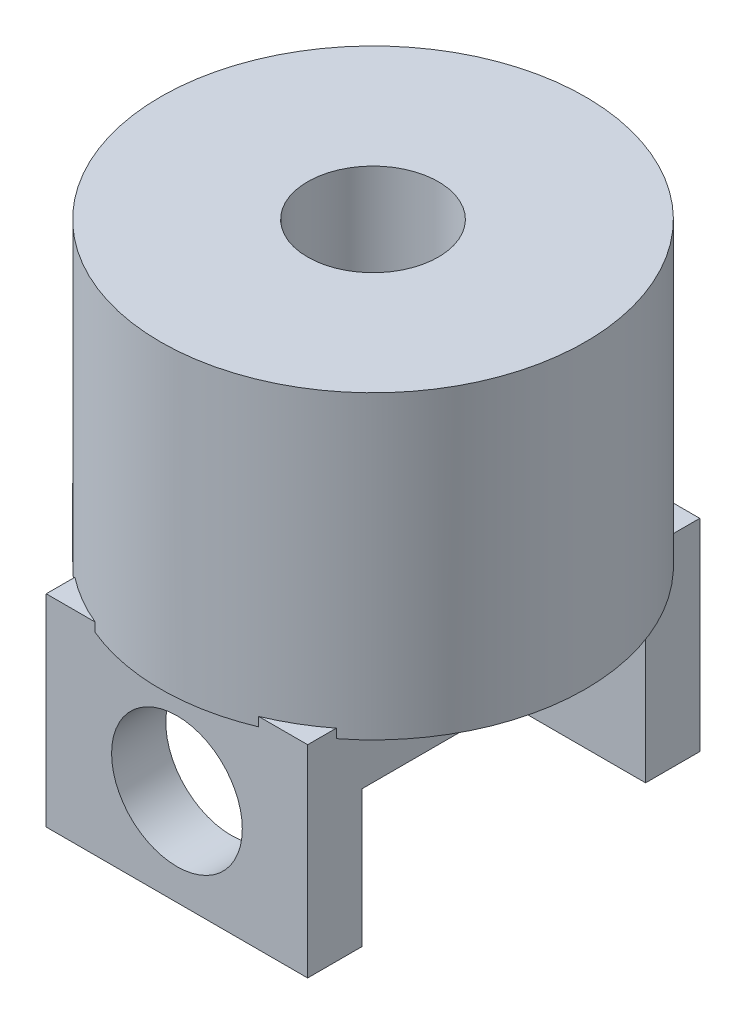
ISO-10303-21;
HEADER;
FILE_DESCRIPTION(('STEP AP214'),'2;1');
FILE_NAME('part.step','',(''),(''),'','','');
FILE_SCHEMA(('AUTOMOTIVE_DESIGN { 1 0 10303 214 1 1 1 1 }'));
ENDSEC;
DATA;
#1=APPLICATION_CONTEXT('core data for automotive mechanical design processes');
#2=APPLICATION_PROTOCOL_DEFINITION('international standard','automotive_design',2000,#1);
#3=PRODUCT_CONTEXT('',#1,'mechanical');
#4=PRODUCT('Part','Part','',(#3));
#5=PRODUCT_RELATED_PRODUCT_CATEGORY('part','',(#4));
#6=PRODUCT_DEFINITION_FORMATION('','',#4);
#7=PRODUCT_DEFINITION_CONTEXT('part definition',#1,'design');
#8=PRODUCT_DEFINITION('design','',#6,#7);
#9=PRODUCT_DEFINITION_SHAPE('','',#8);
#10=(LENGTH_UNIT() NAMED_UNIT(*) SI_UNIT(.MILLI.,.METRE.));
#11=(NAMED_UNIT(*) PLANE_ANGLE_UNIT() SI_UNIT($,.RADIAN.));
#12=(NAMED_UNIT(*) SI_UNIT($,.STERADIAN.) SOLID_ANGLE_UNIT());
#13=UNCERTAINTY_MEASURE_WITH_UNIT(LENGTH_MEASURE(1.E-05),#10,'distance_accuracy_value','');
#14=(GEOMETRIC_REPRESENTATION_CONTEXT(3) GLOBAL_UNCERTAINTY_ASSIGNED_CONTEXT((#13)) GLOBAL_UNIT_ASSIGNED_CONTEXT((#10,
#11,#12)) REPRESENTATION_CONTEXT('',''));
#15=CARTESIAN_POINT('',(0.,0.,0.));
#16=DIRECTION('',(0.,0.,1.));
#17=DIRECTION('',(1.,0.,0.));
#18=AXIS2_PLACEMENT_3D('',#15,#16,#17);
#19=CARTESIAN_POINT('',(20.,-8.61230714938621,21.7089557713652));
#20=DIRECTION('',(0.,1.,0.));
#21=DIRECTION('',(0.,0.,1.));
#22=AXIS2_PLACEMENT_3D('',#19,#20,#21);
#23=PLANE('',#22);
#24=DIRECTION('',(-1.,0.,0.));
#25=VECTOR('',#24,1.);
#26=CARTESIAN_POINT('',(20.,-8.61230714938621,-21.7089557713652));
#27=LINE('',#26,#25);
#28=CARTESIAN_POINT('',(-7.88473942151603,-8.61230714938621,-21.7089557713652));
#29=VERTEX_POINT('',#28);
#30=CARTESIAN_POINT('',(-20.,-8.61230714938621,-21.7089557713652));
#31=VERTEX_POINT('',#30);
#32=EDGE_CURVE('E192',#29,#31,#27,.T.);
#33=ORIENTED_EDGE('',*,*,#32,.F.);
#34=DIRECTION('',(0.,0.,1.));
#35=VECTOR('',#34,1.);
#36=CARTESIAN_POINT('',(-7.88473942151603,-8.61230714938621,-42.));
#37=LINE('',#36,#35);
#38=CARTESIAN_POINT('',(-7.88473942151603,-8.61230714938621,21.7089557713652));
#39=VERTEX_POINT('',#38);
#40=EDGE_CURVE('E61',#29,#39,#37,.T.);
#41=ORIENTED_EDGE('',*,*,#40,.T.);
#42=DIRECTION('',(-1.,0.,0.));
#43=VECTOR('',#42,1.);
#44=CARTESIAN_POINT('',(20.,-8.61230714938621,21.7089557713652));
#45=LINE('',#44,#43);
#46=CARTESIAN_POINT('',(-20.,-8.61230714938621,21.7089557713652));
#47=VERTEX_POINT('',#46);
#48=EDGE_CURVE('E191',#39,#47,#45,.T.);
#49=ORIENTED_EDGE('',*,*,#48,.T.);
#50=DIRECTION('',(0.,0.,-1.));
#51=VECTOR('',#50,1.);
#52=CARTESIAN_POINT('',(-20.,-8.61230714938621,21.7089557713652));
#53=LINE('',#52,#51);
#54=EDGE_CURVE('E324',#47,#31,#53,.T.);
#55=ORIENTED_EDGE('',*,*,#54,.T.);
#56=EDGE_LOOP('',(#33,#41,#49,#55));
#57=FACE_BOUND('',#56,.T.);
#58=ADVANCED_FACE('F45',(#57),#23,.F.);
#59=CARTESIAN_POINT('',(0.,46.,0.));
#60=DIRECTION('',(0.,-1.,0.));
#61=DIRECTION('',(0.,0.,-1.));
#62=AXIS2_PLACEMENT_3D('',#59,#60,#61);
#63=CYLINDRICAL_SURFACE('',#62,32.5);
#64=CARTESIAN_POINT('',(0.,46.,0.));
#65=DIRECTION('',(0.,1.,0.));
#66=DIRECTION('',(0.,0.,1.));
#67=AXIS2_PLACEMENT_3D('',#64,#65,#66);
#68=CIRCLE('',#67,32.5);
#69=CARTESIAN_POINT('',(0.,46.,32.5));
#70=VERTEX_POINT('',#69);
#71=EDGE_CURVE('E247',#70,#70,#68,.T.);
#72=ORIENTED_EDGE('',*,*,#71,.F.);
#73=EDGE_LOOP('',(#72));
#74=FACE_BOUND('',#73,.T.);
#75=DIRECTION('',(0.,-1.,0.));
#76=VECTOR('',#75,1.);
#77=CARTESIAN_POINT('',(12.5,46.,30.));
#78=LINE('',#77,#76);
#79=CARTESIAN_POINT('',(12.5,1.38769285061378,30.));
#80=VERTEX_POINT('',#79);
#81=CARTESIAN_POINT('',(12.5,0.,30.));
#82=VERTEX_POINT('',#81);
#83=EDGE_CURVE('E68',#80,#82,#78,.T.);
#84=ORIENTED_EDGE('',*,*,#83,.F.);
#85=CARTESIAN_POINT('',(0.,1.38769285061378,0.));
#86=DIRECTION('',(0.,-1.,0.));
#87=DIRECTION('',(0.,0.,-1.));
#88=AXIS2_PLACEMENT_3D('',#85,#86,#87);
#89=CIRCLE('',#88,32.5);
#90=CARTESIAN_POINT('',(20.,1.38769285061378,25.617376914899));
#91=VERTEX_POINT('',#90);
#92=EDGE_CURVE('E54',#91,#80,#89,.T.);
#93=ORIENTED_EDGE('',*,*,#92,.F.);
#94=DIRECTION('',(0.,-1.,0.));
#95=VECTOR('',#94,1.);
#96=CARTESIAN_POINT('',(20.,46.,25.617376914899));
#97=LINE('',#96,#95);
#98=CARTESIAN_POINT('',(20.,0.,25.617376914899));
#99=VERTEX_POINT('',#98);
#100=EDGE_CURVE('E221',#91,#99,#97,.T.);
#101=ORIENTED_EDGE('',*,*,#100,.T.);
#102=CARTESIAN_POINT('',(0.,0.,0.));
#103=DIRECTION('',(0.,1.,0.));
#104=DIRECTION('',(0.,0.,1.));
#105=AXIS2_PLACEMENT_3D('',#102,#103,#104);
#106=CIRCLE('',#105,32.5);
#107=CARTESIAN_POINT('',(20.,0.,-25.617376914899));
#108=VERTEX_POINT('',#107);
#109=EDGE_CURVE('E252',#99,#108,#106,.T.);
#110=ORIENTED_EDGE('',*,*,#109,.T.);
#111=DIRECTION('',(0.,-1.,0.));
#112=VECTOR('',#111,1.);
#113=CARTESIAN_POINT('',(20.,46.,-25.617376914899));
#114=LINE('',#113,#112);
#115=CARTESIAN_POINT('',(20.,1.38769285061378,-25.617376914899));
#116=VERTEX_POINT('',#115);
#117=EDGE_CURVE('E218',#108,#116,#114,.F.);
#118=ORIENTED_EDGE('',*,*,#117,.T.);
#119=CARTESIAN_POINT('',(12.5,1.38769285061378,-30.));
#120=VERTEX_POINT('',#119);
#121=EDGE_CURVE('E278',#120,#116,#89,.T.);
#122=ORIENTED_EDGE('',*,*,#121,.F.);
#123=DIRECTION('',(0.,-1.,0.));
#124=VECTOR('',#123,1.);
#125=CARTESIAN_POINT('',(12.5,46.,-30.));
#126=LINE('',#125,#124);
#127=CARTESIAN_POINT('',(12.5,0.,-30.));
#128=VERTEX_POINT('',#127);
#129=EDGE_CURVE('E224',#128,#120,#126,.F.);
#130=ORIENTED_EDGE('',*,*,#129,.F.);
#131=CARTESIAN_POINT('',(-12.5,0.,-30.));
#132=VERTEX_POINT('',#131);
#133=EDGE_CURVE('E444',#128,#132,#106,.T.);
#134=ORIENTED_EDGE('',*,*,#133,.T.);
#135=DIRECTION('',(0.,-1.,0.));
#136=VECTOR('',#135,1.);
#137=CARTESIAN_POINT('',(-12.5,46.,-30.));
#138=LINE('',#137,#136);
#139=CARTESIAN_POINT('',(-12.5,1.38769285061378,-30.));
#140=VERTEX_POINT('',#139);
#141=EDGE_CURVE('E228',#140,#132,#138,.T.);
#142=ORIENTED_EDGE('',*,*,#141,.F.);
#143=CARTESIAN_POINT('',(-20.,1.38769285061378,-25.617376914899));
#144=VERTEX_POINT('',#143);
#145=EDGE_CURVE('E269',#144,#140,#89,.T.);
#146=ORIENTED_EDGE('',*,*,#145,.F.);
#147=DIRECTION('',(0.,-1.,0.));
#148=VECTOR('',#147,1.);
#149=CARTESIAN_POINT('',(-20.,46.,-25.617376914899));
#150=LINE('',#149,#148);
#151=CARTESIAN_POINT('',(-20.,0.,-25.617376914899));
#152=VERTEX_POINT('',#151);
#153=EDGE_CURVE('E210',#152,#144,#150,.F.);
#154=ORIENTED_EDGE('',*,*,#153,.F.);
#155=CARTESIAN_POINT('',(-20.,0.,25.617376914899));
#156=VERTEX_POINT('',#155);
#157=EDGE_CURVE('E255',#152,#156,#106,.T.);
#158=ORIENTED_EDGE('',*,*,#157,.T.);
#159=DIRECTION('',(0.,-1.,0.));
#160=VECTOR('',#159,1.);
#161=CARTESIAN_POINT('',(-20.,46.,25.617376914899));
#162=LINE('',#161,#160);
#163=CARTESIAN_POINT('',(-20.,1.38769285061378,25.617376914899));
#164=VERTEX_POINT('',#163);
#165=EDGE_CURVE('E214',#164,#156,#162,.T.);
#166=ORIENTED_EDGE('',*,*,#165,.F.);
#167=CARTESIAN_POINT('',(-12.5,1.38769285061378,30.));
#168=VERTEX_POINT('',#167);
#169=EDGE_CURVE('E272',#168,#164,#89,.T.);
#170=ORIENTED_EDGE('',*,*,#169,.F.);
#171=DIRECTION('',(0.,-1.,0.));
#172=VECTOR('',#171,1.);
#173=CARTESIAN_POINT('',(-12.5,46.,30.));
#174=LINE('',#173,#172);
#175=CARTESIAN_POINT('',(-12.5,0.,30.));
#176=VERTEX_POINT('',#175);
#177=EDGE_CURVE('E232',#176,#168,#174,.F.);
#178=ORIENTED_EDGE('',*,*,#177,.F.);
#179=EDGE_CURVE('E243',#176,#82,#106,.T.);
#180=ORIENTED_EDGE('',*,*,#179,.T.);
#181=EDGE_LOOP('',(#84,#93,#101,#110,#118,#122,#130,#134,#142,#146,#154,#158,#166,#170,#178,#180));
#182=FACE_BOUND('',#181,.T.);
#183=ADVANCED_FACE('F47',(#74,#182),#63,.T.);
#184=CARTESIAN_POINT('',(0.,0.,0.));
#185=DIRECTION('',(0.,1.,0.));
#186=DIRECTION('',(0.,0.,1.));
#187=AXIS2_PLACEMENT_3D('',#184,#185,#186);
#188=PLANE('',#187);
#189=DIRECTION('',(-1.,0.,0.));
#190=VECTOR('',#189,1.);
#191=CARTESIAN_POINT('',(0.,0.,30.));
#192=LINE('',#191,#190);
#193=EDGE_CURVE('E266',#82,#176,#192,.T.);
#194=ORIENTED_EDGE('',*,*,#193,.F.);
#195=ORIENTED_EDGE('',*,*,#179,.F.);
#196=EDGE_LOOP('',(#194,#195));
#197=FACE_BOUND('',#196,.T.);
#198=ADVANCED_FACE('F393',(#197),#188,.F.);
#199=DIRECTION('',(1.,0.,0.));
#200=VECTOR('',#199,1.);
#201=CARTESIAN_POINT('',(0.,0.,-30.));
#202=LINE('',#201,#200);
#203=EDGE_CURVE('E262',#132,#128,#202,.T.);
#204=ORIENTED_EDGE('',*,*,#203,.F.);
#205=ORIENTED_EDGE('',*,*,#133,.F.);
#206=EDGE_LOOP('',(#204,#205));
#207=FACE_BOUND('',#206,.T.);
#208=ADVANCED_FACE('F434',(#207),#188,.F.);
#209=DIRECTION('',(0.,0.,-1.));
#210=VECTOR('',#209,1.);
#211=CARTESIAN_POINT('',(-20.,0.,0.));
#212=LINE('',#211,#210);
#213=EDGE_CURVE('E251',#156,#152,#212,.T.);
#214=ORIENTED_EDGE('',*,*,#213,.F.);
#215=ORIENTED_EDGE('',*,*,#157,.F.);
#216=EDGE_LOOP('',(#214,#215));
#217=FACE_BOUND('',#216,.T.);
#218=ADVANCED_FACE('F425',(#217),#188,.F.);
#219=CARTESIAN_POINT('',(0.,46.,0.));
#220=DIRECTION('',(0.,1.,0.));
#221=DIRECTION('',(0.,0.,1.));
#222=AXIS2_PLACEMENT_3D('',#219,#220,#221);
#223=PLANE('',#222);
#224=CARTESIAN_POINT('',(0.,46.,0.));
#225=DIRECTION('',(0.,1.,0.));
#226=DIRECTION('',(0.,0.,1.));
#227=AXIS2_PLACEMENT_3D('',#224,#225,#226);
#228=CIRCLE('',#227,10.);
#229=CARTESIAN_POINT('',(0.,46.,10.));
#230=VERTEX_POINT('',#229);
#231=EDGE_CURVE('E238',#230,#230,#228,.T.);
#232=ORIENTED_EDGE('',*,*,#231,.F.);
#233=EDGE_LOOP('',(#232));
#234=FACE_BOUND('',#233,.T.);
#235=ORIENTED_EDGE('',*,*,#71,.T.);
#236=EDGE_LOOP('',(#235));
#237=FACE_BOUND('',#236,.T.);
#238=ADVANCED_FACE('F423',(#234,#237),#223,.T.);
#239=ORIENTED_EDGE('',*,*,#109,.F.);
#240=DIRECTION('',(0.,0.,-1.));
#241=VECTOR('',#240,1.);
#242=CARTESIAN_POINT('',(20.,0.,0.));
#243=LINE('',#242,#241);
#244=EDGE_CURVE('E259',#99,#108,#243,.T.);
#245=ORIENTED_EDGE('',*,*,#244,.T.);
#246=EDGE_LOOP('',(#239,#245));
#247=FACE_BOUND('',#246,.T.);
#248=ADVANCED_FACE('F421',(#247),#188,.F.);
#249=CARTESIAN_POINT('',(0.,6.,0.));
#250=DIRECTION('',(0.,1.,0.));
#251=DIRECTION('',(0.,0.,1.));
#252=AXIS2_PLACEMENT_3D('',#249,#250,#251);
#253=CYLINDRICAL_SURFACE('',#252,10.);
#254=CARTESIAN_POINT('',(0.,6.,0.));
#255=DIRECTION('',(0.,1.,0.));
#256=DIRECTION('',(0.,0.,1.));
#257=AXIS2_PLACEMENT_3D('',#254,#255,#256);
#258=CIRCLE('',#257,10.);
#259=CARTESIAN_POINT('',(0.,6.,10.));
#260=VERTEX_POINT('',#259);
#261=EDGE_CURVE('E239',#260,#260,#258,.T.);
#262=ORIENTED_EDGE('',*,*,#261,.F.);
#263=EDGE_LOOP('',(#262));
#264=FACE_BOUND('',#263,.T.);
#265=ORIENTED_EDGE('',*,*,#231,.T.);
#266=EDGE_LOOP('',(#265));
#267=FACE_BOUND('',#266,.T.);
#268=ADVANCED_FACE('F417',(#264,#267),#253,.F.);
#269=CARTESIAN_POINT('',(0.,6.,0.));
#270=DIRECTION('',(0.,1.,0.));
#271=DIRECTION('',(0.,0.,1.));
#272=AXIS2_PLACEMENT_3D('',#269,#270,#271);
#273=PLANE('',#272);
#274=ORIENTED_EDGE('',*,*,#261,.T.);
#275=EDGE_LOOP('',(#274));
#276=FACE_BOUND('',#275,.T.);
#277=ADVANCED_FACE('F383',(#276),#273,.T.);
#278=CARTESIAN_POINT('',(20.,1.38769285061378,-30.));
#279=DIRECTION('',(0.,-1.,0.));
#280=DIRECTION('',(0.,0.,-1.));
#281=AXIS2_PLACEMENT_3D('',#278,#279,#280);
#282=PLANE('',#281);
#283=DIRECTION('',(-1.,0.,0.));
#284=VECTOR('',#283,1.);
#285=CARTESIAN_POINT('',(20.,1.38769285061378,-30.));
#286=LINE('',#285,#284);
#287=CARTESIAN_POINT('',(20.,1.38769285061378,-30.));
#288=VERTEX_POINT('',#287);
#289=EDGE_CURVE('E293',#288,#120,#286,.T.);
#290=ORIENTED_EDGE('',*,*,#289,.T.);
#291=ORIENTED_EDGE('',*,*,#121,.T.);
#292=DIRECTION('',(0.,0.,1.));
#293=VECTOR('',#292,1.);
#294=CARTESIAN_POINT('',(20.,1.38769285061378,-30.));
#295=LINE('',#294,#293);
#296=EDGE_CURVE('E291',#288,#116,#295,.T.);
#297=ORIENTED_EDGE('',*,*,#296,.F.);
#298=EDGE_LOOP('',(#290,#291,#297));
#299=FACE_BOUND('',#298,.T.);
#300=ADVANCED_FACE('F290',(#299),#282,.F.);
#301=CARTESIAN_POINT('',(20.,1.38769285061378,30.));
#302=VERTEX_POINT('',#301);
#303=EDGE_CURVE('E303',#91,#302,#295,.T.);
#304=ORIENTED_EDGE('',*,*,#303,.F.);
#305=ORIENTED_EDGE('',*,*,#92,.T.);
#306=DIRECTION('',(-1.,0.,0.));
#307=VECTOR('',#306,1.);
#308=CARTESIAN_POINT('',(20.,1.38769285061378,30.));
#309=LINE('',#308,#307);
#310=EDGE_CURVE('E307',#302,#80,#309,.T.);
#311=ORIENTED_EDGE('',*,*,#310,.F.);
#312=EDGE_LOOP('',(#304,#305,#311));
#313=FACE_BOUND('',#312,.T.);
#314=ADVANCED_FACE('F382',(#313),#282,.F.);
#315=CARTESIAN_POINT('',(-20.,1.38769285061378,30.));
#316=VERTEX_POINT('',#315);
#317=EDGE_CURVE('E302',#168,#316,#309,.T.);
#318=ORIENTED_EDGE('',*,*,#317,.F.);
#319=ORIENTED_EDGE('',*,*,#169,.T.);
#320=DIRECTION('',(0.,0.,1.));
#321=VECTOR('',#320,1.);
#322=CARTESIAN_POINT('',(-20.,1.38769285061378,-30.));
#323=LINE('',#322,#321);
#324=EDGE_CURVE('E338',#164,#316,#323,.T.);
#325=ORIENTED_EDGE('',*,*,#324,.T.);
#326=EDGE_LOOP('',(#318,#319,#325));
#327=FACE_BOUND('',#326,.T.);
#328=ADVANCED_FACE('F370',(#327),#282,.F.);
#329=CARTESIAN_POINT('',(20.,1.38769285061378,30.));
#330=DIRECTION('',(0.,0.,-1.));
#331=DIRECTION('',(0.,1.,0.));
#332=AXIS2_PLACEMENT_3D('',#329,#330,#331);
#333=PLANE('',#332);
#334=CARTESIAN_POINT('',(0.,-14.7629887583456,30.));
#335=DIRECTION('',(0.,0.,-1.));
#336=DIRECTION('',(0.,1.,0.));
#337=AXIS2_PLACEMENT_3D('',#334,#335,#336);
#338=CIRCLE('',#337,10.);
#339=CARTESIAN_POINT('',(0.,-4.76298875834558,30.));
#340=VERTEX_POINT('',#339);
#341=EDGE_CURVE('E317',#340,#340,#338,.T.);
#342=ORIENTED_EDGE('',*,*,#341,.T.);
#343=EDGE_LOOP('',(#342));
#344=FACE_BOUND('',#343,.T.);
#345=ORIENTED_EDGE('',*,*,#310,.T.);
#346=ORIENTED_EDGE('',*,*,#83,.T.);
#347=ORIENTED_EDGE('',*,*,#193,.T.);
#348=ORIENTED_EDGE('',*,*,#177,.T.);
#349=ORIENTED_EDGE('',*,*,#317,.T.);
#350=DIRECTION('',(0.,-1.,0.));
#351=VECTOR('',#350,1.);
#352=CARTESIAN_POINT('',(-20.,1.38769285061378,30.));
#353=LINE('',#352,#351);
#354=CARTESIAN_POINT('',(-20.,-29.5259775166912,30.));
#355=VERTEX_POINT('',#354);
#356=EDGE_CURVE('E312',#316,#355,#353,.T.);
#357=ORIENTED_EDGE('',*,*,#356,.T.);
#358=DIRECTION('',(-1.,0.,0.));
#359=VECTOR('',#358,1.);
#360=CARTESIAN_POINT('',(20.,-29.5259775166912,30.));
#361=LINE('',#360,#359);
#362=CARTESIAN_POINT('',(20.,-29.5259775166912,30.));
#363=VERTEX_POINT('',#362);
#364=EDGE_CURVE('E206',#363,#355,#361,.T.);
#365=ORIENTED_EDGE('',*,*,#364,.F.);
#366=DIRECTION('',(0.,-1.,0.));
#367=VECTOR('',#366,1.);
#368=CARTESIAN_POINT('',(20.,1.38769285061378,30.));
#369=LINE('',#368,#367);
#370=EDGE_CURVE('E341',#302,#363,#369,.T.);
#371=ORIENTED_EDGE('',*,*,#370,.F.);
#372=EDGE_LOOP('',(#345,#346,#347,#348,#349,#357,#365,#371));
#373=FACE_BOUND('',#372,.T.);
#374=ADVANCED_FACE('F385',(#344,#373),#333,.F.);
#375=CARTESIAN_POINT('',(20.,1.38769285061378,-30.));
#376=DIRECTION('',(0.,0.,1.));
#377=DIRECTION('',(0.,-1.,0.));
#378=AXIS2_PLACEMENT_3D('',#375,#376,#377);
#379=PLANE('',#378);
#380=CARTESIAN_POINT('',(0.,-14.7629887583456,-30.));
#381=DIRECTION('',(0.,0.,1.));
#382=DIRECTION('',(0.,-1.,0.));
#383=AXIS2_PLACEMENT_3D('',#380,#381,#382);
#384=CIRCLE('',#383,10.);
#385=CARTESIAN_POINT('',(0.,-24.7629887583456,-30.));
#386=VERTEX_POINT('',#385);
#387=EDGE_CURVE('E453',#386,#386,#384,.T.);
#388=ORIENTED_EDGE('',*,*,#387,.T.);
#389=EDGE_LOOP('',(#388));
#390=FACE_BOUND('',#389,.T.);
#391=CARTESIAN_POINT('',(-20.,1.38769285061378,-30.));
#392=VERTEX_POINT('',#391);
#393=EDGE_CURVE('E344',#140,#392,#286,.T.);
#394=ORIENTED_EDGE('',*,*,#393,.F.);
#395=ORIENTED_EDGE('',*,*,#141,.T.);
#396=ORIENTED_EDGE('',*,*,#203,.T.);
#397=ORIENTED_EDGE('',*,*,#129,.T.);
#398=ORIENTED_EDGE('',*,*,#289,.F.);
#399=DIRECTION('',(0.,1.,0.));
#400=VECTOR('',#399,1.);
#401=CARTESIAN_POINT('',(20.,1.38769285061378,-30.));
#402=LINE('',#401,#400);
#403=CARTESIAN_POINT('',(20.,-29.5259775166912,-30.));
#404=VERTEX_POINT('',#403);
#405=EDGE_CURVE('E300',#404,#288,#402,.T.);
#406=ORIENTED_EDGE('',*,*,#405,.F.);
#407=DIRECTION('',(-1.,0.,0.));
#408=VECTOR('',#407,1.);
#409=CARTESIAN_POINT('',(20.,-29.5259775166912,-30.));
#410=LINE('',#409,#408);
#411=CARTESIAN_POINT('',(-20.,-29.5259775166912,-30.));
#412=VERTEX_POINT('',#411);
#413=EDGE_CURVE('E346',#404,#412,#410,.T.);
#414=ORIENTED_EDGE('',*,*,#413,.T.);
#415=DIRECTION('',(0.,1.,0.));
#416=VECTOR('',#415,1.);
#417=CARTESIAN_POINT('',(-20.,1.38769285061378,-30.));
#418=LINE('',#417,#416);
#419=EDGE_CURVE('E334',#412,#392,#418,.T.);
#420=ORIENTED_EDGE('',*,*,#419,.T.);
#421=EDGE_LOOP('',(#394,#395,#396,#397,#398,#406,#414,#420));
#422=FACE_BOUND('',#421,.T.);
#423=ADVANCED_FACE('F365',(#390,#422),#379,.F.);
#424=CARTESIAN_POINT('',(20.,0.,0.));
#425=DIRECTION('',(1.,0.,0.));
#426=DIRECTION('',(0.,0.,-1.));
#427=AXIS2_PLACEMENT_3D('',#424,#425,#426);
#428=PLANE('',#427);
#429=ORIENTED_EDGE('',*,*,#100,.F.);
#430=ORIENTED_EDGE('',*,*,#303,.T.);
#431=ORIENTED_EDGE('',*,*,#370,.T.);
#432=DIRECTION('',(0.,0.,-1.));
#433=VECTOR('',#432,1.);
#434=CARTESIAN_POINT('',(20.,-29.5259775166912,30.));
#435=LINE('',#434,#433);
#436=CARTESIAN_POINT('',(20.,-29.5259775166912,21.7089557713652));
#437=VERTEX_POINT('',#436);
#438=EDGE_CURVE('E465',#363,#437,#435,.T.);
#439=ORIENTED_EDGE('',*,*,#438,.T.);
#440=DIRECTION('',(0.,1.,0.));
#441=VECTOR('',#440,1.);
#442=CARTESIAN_POINT('',(20.,-29.5259775166912,21.7089557713652));
#443=LINE('',#442,#441);
#444=CARTESIAN_POINT('',(20.,-8.61230714938621,21.7089557713652));
#445=VERTEX_POINT('',#444);
#446=EDGE_CURVE('E468',#437,#445,#443,.T.);
#447=ORIENTED_EDGE('',*,*,#446,.T.);
#448=DIRECTION('',(0.,0.,-1.));
#449=VECTOR('',#448,1.);
#450=CARTESIAN_POINT('',(20.,-8.61230714938621,21.7089557713652));
#451=LINE('',#450,#449);
#452=CARTESIAN_POINT('',(20.,-8.61230714938621,-21.7089557713652));
#453=VERTEX_POINT('',#452);
#454=EDGE_CURVE('E471',#445,#453,#451,.T.);
#455=ORIENTED_EDGE('',*,*,#454,.T.);
#456=DIRECTION('',(0.,-1.,0.));
#457=VECTOR('',#456,1.);
#458=CARTESIAN_POINT('',(20.,-29.5259775166912,-21.7089557713652));
#459=LINE('',#458,#457);
#460=CARTESIAN_POINT('',(20.,-29.5259775166912,-21.7089557713652));
#461=VERTEX_POINT('',#460);
#462=EDGE_CURVE('E189',#453,#461,#459,.T.);
#463=ORIENTED_EDGE('',*,*,#462,.T.);
#464=DIRECTION('',(0.,0.,-1.));
#465=VECTOR('',#464,1.);
#466=CARTESIAN_POINT('',(20.,-29.5259775166912,-30.));
#467=LINE('',#466,#465);
#468=EDGE_CURVE('E358',#461,#404,#467,.T.);
#469=ORIENTED_EDGE('',*,*,#468,.T.);
#470=ORIENTED_EDGE('',*,*,#405,.T.);
#471=ORIENTED_EDGE('',*,*,#296,.T.);
#472=ORIENTED_EDGE('',*,*,#117,.F.);
#473=ORIENTED_EDGE('',*,*,#244,.F.);
#474=EDGE_LOOP('',(#429,#430,#431,#439,#447,#455,#463,#469,#470,#471,#472,#473));
#475=FACE_BOUND('',#474,.T.);
#476=ADVANCED_FACE('F297',(#475),#428,.T.);
#477=CARTESIAN_POINT('',(-20.,0.,0.));
#478=DIRECTION('',(1.,0.,0.));
#479=DIRECTION('',(0.,0.,-1.));
#480=AXIS2_PLACEMENT_3D('',#477,#478,#479);
#481=PLANE('',#480);
#482=ORIENTED_EDGE('',*,*,#324,.F.);
#483=ORIENTED_EDGE('',*,*,#165,.T.);
#484=ORIENTED_EDGE('',*,*,#213,.T.);
#485=ORIENTED_EDGE('',*,*,#153,.T.);
#486=EDGE_CURVE('E339',#392,#144,#323,.T.);
#487=ORIENTED_EDGE('',*,*,#486,.F.);
#488=ORIENTED_EDGE('',*,*,#419,.F.);
#489=DIRECTION('',(0.,0.,-1.));
#490=VECTOR('',#489,1.);
#491=CARTESIAN_POINT('',(-20.,-29.5259775166912,-30.));
#492=LINE('',#491,#490);
#493=CARTESIAN_POINT('',(-20.,-29.5259775166912,-21.7089557713652));
#494=VERTEX_POINT('',#493);
#495=EDGE_CURVE('E331',#494,#412,#492,.T.);
#496=ORIENTED_EDGE('',*,*,#495,.F.);
#497=DIRECTION('',(0.,-1.,0.));
#498=VECTOR('',#497,1.);
#499=CARTESIAN_POINT('',(-20.,-29.5259775166912,-21.7089557713652));
#500=LINE('',#499,#498);
#501=EDGE_CURVE('E328',#31,#494,#500,.T.);
#502=ORIENTED_EDGE('',*,*,#501,.F.);
#503=ORIENTED_EDGE('',*,*,#54,.F.);
#504=DIRECTION('',(0.,1.,0.));
#505=VECTOR('',#504,1.);
#506=CARTESIAN_POINT('',(-20.,-29.5259775166912,21.7089557713652));
#507=LINE('',#506,#505);
#508=CARTESIAN_POINT('',(-20.,-29.5259775166912,21.7089557713652));
#509=VERTEX_POINT('',#508);
#510=EDGE_CURVE('E320',#509,#47,#507,.T.);
#511=ORIENTED_EDGE('',*,*,#510,.F.);
#512=DIRECTION('',(0.,0.,-1.));
#513=VECTOR('',#512,1.);
#514=CARTESIAN_POINT('',(-20.,-29.5259775166912,30.));
#515=LINE('',#514,#513);
#516=EDGE_CURVE('E316',#355,#509,#515,.T.);
#517=ORIENTED_EDGE('',*,*,#516,.F.);
#518=ORIENTED_EDGE('',*,*,#356,.F.);
#519=EDGE_LOOP('',(#482,#483,#484,#485,#487,#488,#496,#502,#503,#511,#517,#518));
#520=FACE_BOUND('',#519,.T.);
#521=ADVANCED_FACE('F362',(#520),#481,.F.);
#522=CARTESIAN_POINT('',(20.,-29.5259775166912,30.));
#523=DIRECTION('',(0.,1.,0.));
#524=DIRECTION('',(0.,0.,1.));
#525=AXIS2_PLACEMENT_3D('',#522,#523,#524);
#526=PLANE('',#525);
#527=ORIENTED_EDGE('',*,*,#516,.T.);
#528=DIRECTION('',(-1.,0.,0.));
#529=VECTOR('',#528,1.);
#530=CARTESIAN_POINT('',(20.,-29.5259775166912,21.7089557713652));
#531=LINE('',#530,#529);
#532=EDGE_CURVE('E202',#437,#509,#531,.T.);
#533=ORIENTED_EDGE('',*,*,#532,.F.);
#534=ORIENTED_EDGE('',*,*,#438,.F.);
#535=ORIENTED_EDGE('',*,*,#364,.T.);
#536=EDGE_LOOP('',(#527,#533,#534,#535));
#537=FACE_BOUND('',#536,.T.);
#538=ADVANCED_FACE('F403',(#537),#526,.F.);
#539=CARTESIAN_POINT('',(20.,-29.5259775166912,21.7089557713652));
#540=DIRECTION('',(0.,0.,1.));
#541=DIRECTION('',(1.,0.,0.));
#542=AXIS2_PLACEMENT_3D('',#539,#540,#541);
#543=PLANE('',#542);
#544=ORIENTED_EDGE('',*,*,#48,.F.);
#545=CARTESIAN_POINT('',(0.,-14.7629887583456,21.7089557713652));
#546=DIRECTION('',(0.,0.,1.));
#547=DIRECTION('',(1.,0.,0.));
#548=AXIS2_PLACEMENT_3D('',#545,#546,#547);
#549=CIRCLE('',#548,10.);
#550=CARTESIAN_POINT('',(7.88473942151603,-8.61230714938621,21.7089557713652));
#551=VERTEX_POINT('',#550);
#552=EDGE_CURVE('E457',#39,#551,#549,.T.);
#553=ORIENTED_EDGE('',*,*,#552,.T.);
#554=EDGE_CURVE('E184',#445,#551,#45,.T.);
#555=ORIENTED_EDGE('',*,*,#554,.F.);
#556=ORIENTED_EDGE('',*,*,#446,.F.);
#557=ORIENTED_EDGE('',*,*,#532,.T.);
#558=ORIENTED_EDGE('',*,*,#510,.T.);
#559=EDGE_LOOP('',(#544,#553,#555,#556,#557,#558));
#560=FACE_BOUND('',#559,.T.);
#561=ADVANCED_FACE('F398',(#560),#543,.F.);
#562=ORIENTED_EDGE('',*,*,#554,.T.);
#563=DIRECTION('',(0.,0.,1.));
#564=VECTOR('',#563,1.);
#565=CARTESIAN_POINT('',(7.88473942151603,-8.61230714938621,-42.));
#566=LINE('',#565,#564);
#567=CARTESIAN_POINT('',(7.88473942151603,-8.61230714938621,-21.7089557713652));
#568=VERTEX_POINT('',#567);
#569=EDGE_CURVE('E171',#551,#568,#566,.F.);
#570=ORIENTED_EDGE('',*,*,#569,.T.);
#571=EDGE_CURVE('E181',#453,#568,#27,.T.);
#572=ORIENTED_EDGE('',*,*,#571,.F.);
#573=ORIENTED_EDGE('',*,*,#454,.F.);
#574=EDGE_LOOP('',(#562,#570,#572,#573));
#575=FACE_BOUND('',#574,.T.);
#576=ADVANCED_FACE('F179',(#575),#23,.F.);
#577=CARTESIAN_POINT('',(20.,-29.5259775166912,-21.7089557713652));
#578=DIRECTION('',(0.,0.,-1.));
#579=DIRECTION('',(-1.,0.,0.));
#580=AXIS2_PLACEMENT_3D('',#577,#578,#579);
#581=PLANE('',#580);
#582=ORIENTED_EDGE('',*,*,#571,.T.);
#583=CARTESIAN_POINT('',(0.,-14.7629887583456,-21.7089557713652));
#584=DIRECTION('',(0.,0.,-1.));
#585=DIRECTION('',(-1.,0.,0.));
#586=AXIS2_PLACEMENT_3D('',#583,#584,#585);
#587=CIRCLE('',#586,10.);
#588=EDGE_CURVE('E11',#568,#29,#587,.T.);
#589=ORIENTED_EDGE('',*,*,#588,.T.);
#590=ORIENTED_EDGE('',*,*,#32,.T.);
#591=ORIENTED_EDGE('',*,*,#501,.T.);
#592=DIRECTION('',(-1.,0.,0.));
#593=VECTOR('',#592,1.);
#594=CARTESIAN_POINT('',(20.,-29.5259775166912,-21.7089557713652));
#595=LINE('',#594,#593);
#596=EDGE_CURVE('E197',#461,#494,#595,.T.);
#597=ORIENTED_EDGE('',*,*,#596,.F.);
#598=ORIENTED_EDGE('',*,*,#462,.F.);
#599=EDGE_LOOP('',(#582,#589,#590,#591,#597,#598));
#600=FACE_BOUND('',#599,.T.);
#601=ADVANCED_FACE('F187',(#600),#581,.F.);
#602=CARTESIAN_POINT('',(20.,-29.5259775166912,-30.));
#603=DIRECTION('',(0.,1.,0.));
#604=DIRECTION('',(0.,0.,1.));
#605=AXIS2_PLACEMENT_3D('',#602,#603,#604);
#606=PLANE('',#605);
#607=ORIENTED_EDGE('',*,*,#495,.T.);
#608=ORIENTED_EDGE('',*,*,#413,.F.);
#609=ORIENTED_EDGE('',*,*,#468,.F.);
#610=ORIENTED_EDGE('',*,*,#596,.T.);
#611=EDGE_LOOP('',(#607,#608,#609,#610));
#612=FACE_BOUND('',#611,.T.);
#613=ADVANCED_FACE('F357',(#612),#606,.F.);
#614=ORIENTED_EDGE('',*,*,#486,.T.);
#615=ORIENTED_EDGE('',*,*,#145,.T.);
#616=ORIENTED_EDGE('',*,*,#393,.T.);
#617=EDGE_LOOP('',(#614,#615,#616));
#618=FACE_BOUND('',#617,.T.);
#619=ADVANCED_FACE('F367',(#618),#282,.F.);
#620=CARTESIAN_POINT('',(0.,-14.7629887583456,-42.));
#621=DIRECTION('',(0.,0.,1.));
#622=DIRECTION('',(1.,0.,0.));
#623=AXIS2_PLACEMENT_3D('',#620,#621,#622);
#624=CYLINDRICAL_SURFACE('',#623,10.);
#625=ORIENTED_EDGE('',*,*,#387,.F.);
#626=EDGE_LOOP('',(#625));
#627=FACE_BOUND('',#626,.T.);
#628=ORIENTED_EDGE('',*,*,#40,.F.);
#629=ORIENTED_EDGE('',*,*,#588,.F.);
#630=ORIENTED_EDGE('',*,*,#569,.F.);
#631=ORIENTED_EDGE('',*,*,#552,.F.);
#632=EDGE_LOOP('',(#628,#629,#630,#631));
#633=FACE_BOUND('',#632,.T.);
#634=ORIENTED_EDGE('',*,*,#341,.F.);
#635=EDGE_LOOP('',(#634));
#636=FACE_BOUND('',#635,.T.);
#637=ADVANCED_FACE('F169',(#627,#633,#636),#624,.F.);
#638=CLOSED_SHELL('',(#58,#183,#198,#208,#218,#238,#248,#268,#277,#300,#314,#328,#374,#423,#476,
#521,#538,#561,#576,#601,#613,#619,#637));
#639=MANIFOLD_SOLID_BREP('B2',#638);
#640=ADVANCED_BREP_SHAPE_REPRESENTATION('',(#18,#639),#14);
#641=SHAPE_DEFINITION_REPRESENTATION(#9,#640);
ENDSEC;
END-ISO-10303-21;
